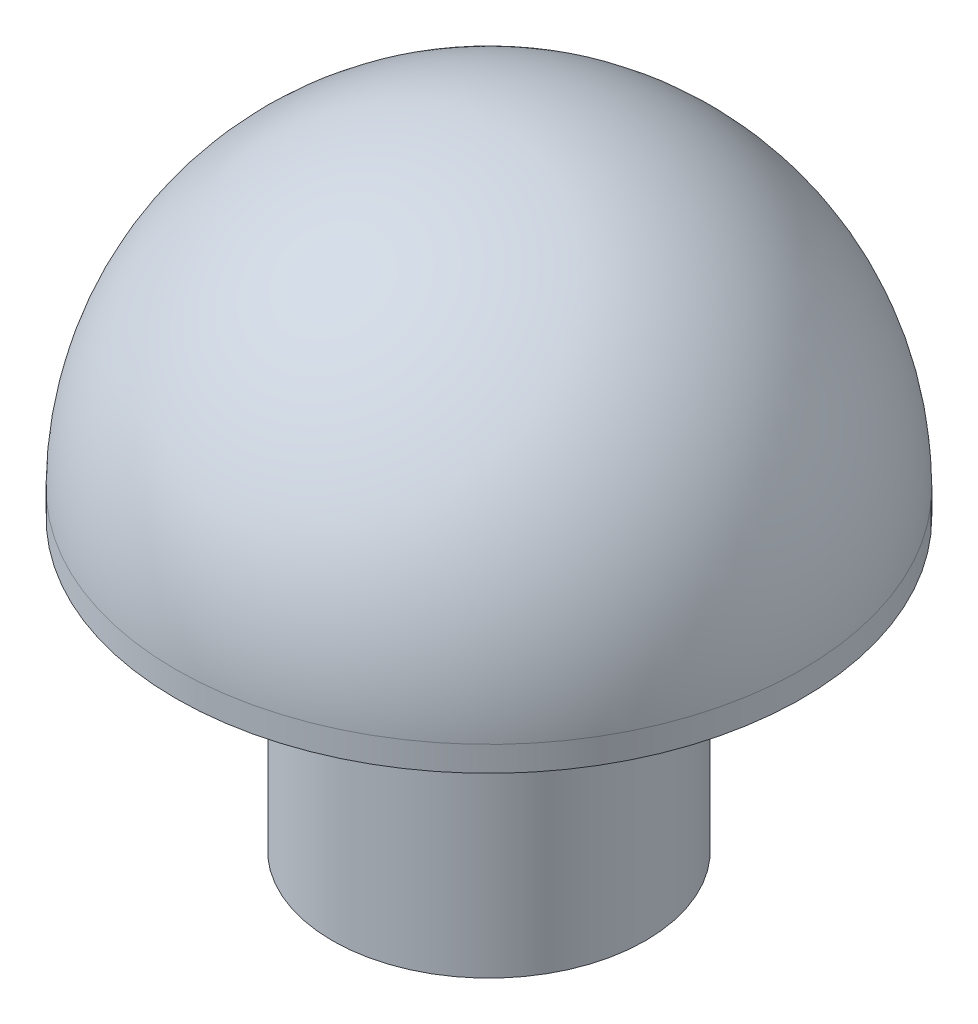
ISO-10303-21;
HEADER;
FILE_DESCRIPTION(('STEP AP214'),'2;1');
FILE_NAME('part.step','',(''),(''),'','','');
FILE_SCHEMA(('AUTOMOTIVE_DESIGN { 1 0 10303 214 1 1 1 1 }'));
ENDSEC;
DATA;
#1=APPLICATION_CONTEXT('core data for automotive mechanical design processes');
#2=APPLICATION_PROTOCOL_DEFINITION('international standard','automotive_design',2000,#1);
#3=PRODUCT_CONTEXT('',#1,'mechanical');
#4=PRODUCT('Part','Part','',(#3));
#5=PRODUCT_RELATED_PRODUCT_CATEGORY('part','',(#4));
#6=PRODUCT_DEFINITION_FORMATION('','',#4);
#7=PRODUCT_DEFINITION_CONTEXT('part definition',#1,'design');
#8=PRODUCT_DEFINITION('design','',#6,#7);
#9=PRODUCT_DEFINITION_SHAPE('','',#8);
#10=(LENGTH_UNIT() NAMED_UNIT(*) SI_UNIT(.MILLI.,.METRE.));
#11=(NAMED_UNIT(*) PLANE_ANGLE_UNIT() SI_UNIT($,.RADIAN.));
#12=(NAMED_UNIT(*) SI_UNIT($,.STERADIAN.) SOLID_ANGLE_UNIT());
#13=UNCERTAINTY_MEASURE_WITH_UNIT(LENGTH_MEASURE(1.E-05),#10,'distance_accuracy_value','');
#14=(GEOMETRIC_REPRESENTATION_CONTEXT(3) GLOBAL_UNCERTAINTY_ASSIGNED_CONTEXT((#13)) GLOBAL_UNIT_ASSIGNED_CONTEXT((#10,
#11,#12)) REPRESENTATION_CONTEXT('',''));
#15=CARTESIAN_POINT('',(0.,0.,0.));
#16=DIRECTION('',(0.,0.,1.));
#17=DIRECTION('',(1.,0.,0.));
#18=AXIS2_PLACEMENT_3D('',#15,#16,#17);
#19=CARTESIAN_POINT('',(0.,10.,0.));
#20=DIRECTION('',(0.,-1.,0.));
#21=DIRECTION('',(0.,0.,-1.));
#22=AXIS2_PLACEMENT_3D('',#19,#20,#21);
#23=CYLINDRICAL_SURFACE('',#22,2.5);
#24=CARTESIAN_POINT('',(0.,0.,0.));
#25=DIRECTION('',(0.,1.,0.));
#26=DIRECTION('',(0.,0.,1.));
#27=AXIS2_PLACEMENT_3D('',#24,#25,#26);
#28=CIRCLE('',#27,2.5);
#29=CARTESIAN_POINT('',(0.,0.,2.5));
#30=VERTEX_POINT('',#29);
#31=EDGE_CURVE('E50',#30,#30,#28,.T.);
#32=ORIENTED_EDGE('',*,*,#31,.T.);
#33=EDGE_LOOP('',(#32));
#34=FACE_BOUND('',#33,.T.);
#35=CARTESIAN_POINT('',(0.,4.6,0.));
#36=DIRECTION('',(0.,1.,0.));
#37=DIRECTION('',(0.,0.,1.));
#38=AXIS2_PLACEMENT_3D('',#35,#36,#37);
#39=CIRCLE('',#38,2.5);
#40=CARTESIAN_POINT('',(0.,4.6,2.5));
#41=VERTEX_POINT('',#40);
#42=EDGE_CURVE('E45',#41,#41,#39,.T.);
#43=ORIENTED_EDGE('',*,*,#42,.F.);
#44=EDGE_LOOP('',(#43));
#45=FACE_BOUND('',#44,.T.);
#46=ADVANCED_FACE('F37',(#34,#45),#23,.T.);
#47=CARTESIAN_POINT('',(0.,0.,0.));
#48=DIRECTION('',(0.,1.,0.));
#49=DIRECTION('',(0.,0.,1.));
#50=AXIS2_PLACEMENT_3D('',#47,#48,#49);
#51=PLANE('',#50);
#52=ORIENTED_EDGE('',*,*,#31,.F.);
#53=EDGE_LOOP('',(#52));
#54=FACE_BOUND('',#53,.T.);
#55=ADVANCED_FACE('F72',(#54),#51,.F.);
#56=CARTESIAN_POINT('',(0.,4.6,0.));
#57=DIRECTION('',(0.,1.,0.));
#58=DIRECTION('',(0.,0.,1.));
#59=AXIS2_PLACEMENT_3D('',#56,#57,#58);
#60=CYLINDRICAL_SURFACE('',#59,5.);
#61=CARTESIAN_POINT('',(0.,5.,0.));
#62=DIRECTION('',(0.,1.,0.));
#63=DIRECTION('',(0.,0.,1.));
#64=AXIS2_PLACEMENT_3D('',#61,#62,#63);
#65=CIRCLE('',#64,5.);
#66=CARTESIAN_POINT('',(0.,5.,5.));
#67=VERTEX_POINT('',#66);
#68=EDGE_CURVE('E10',#67,#67,#65,.F.);
#69=ORIENTED_EDGE('',*,*,#68,.T.);
#70=EDGE_LOOP('',(#69));
#71=FACE_BOUND('',#70,.T.);
#72=CARTESIAN_POINT('',(0.,4.6,0.));
#73=DIRECTION('',(0.,1.,0.));
#74=DIRECTION('',(0.,0.,1.));
#75=AXIS2_PLACEMENT_3D('',#72,#73,#74);
#76=CIRCLE('',#75,5.);
#77=CARTESIAN_POINT('',(0.,4.6,5.));
#78=VERTEX_POINT('',#77);
#79=EDGE_CURVE('E55',#78,#78,#76,.T.);
#80=ORIENTED_EDGE('',*,*,#79,.T.);
#81=EDGE_LOOP('',(#80));
#82=FACE_BOUND('',#81,.T.);
#83=ADVANCED_FACE('F62',(#71,#82),#60,.T.);
#84=CARTESIAN_POINT('',(0.,4.6,0.));
#85=DIRECTION('',(0.,1.,0.));
#86=DIRECTION('',(0.,0.,1.));
#87=AXIS2_PLACEMENT_3D('',#84,#85,#86);
#88=PLANE('',#87);
#89=ORIENTED_EDGE('',*,*,#42,.T.);
#90=EDGE_LOOP('',(#89));
#91=FACE_BOUND('',#90,.T.);
#92=ORIENTED_EDGE('',*,*,#79,.F.);
#93=EDGE_LOOP('',(#92));
#94=FACE_BOUND('',#93,.T.);
#95=ADVANCED_FACE('F64',(#91,#94),#88,.F.);
#96=CARTESIAN_POINT('',(0.,5.,0.));
#97=DIRECTION('',(0.,1.,0.));
#98=DIRECTION('',(0.,0.,1.));
#99=AXIS2_PLACEMENT_3D('',#96,#97,#98);
#100=SPHERICAL_SURFACE('',#99,5.);
#101=ORIENTED_EDGE('',*,*,#68,.F.);
#102=EDGE_LOOP('',(#101));
#103=FACE_BOUND('',#102,.T.);
#104=ADVANCED_FACE('F39',(#103),#100,.T.);
#105=CLOSED_SHELL('',(#46,#55,#83,#95,#104));
#106=MANIFOLD_SOLID_BREP('B2',#105);
#107=ADVANCED_BREP_SHAPE_REPRESENTATION('',(#18,#106),#14);
#108=SHAPE_DEFINITION_REPRESENTATION(#9,#107);
ENDSEC;
END-ISO-10303-21;
